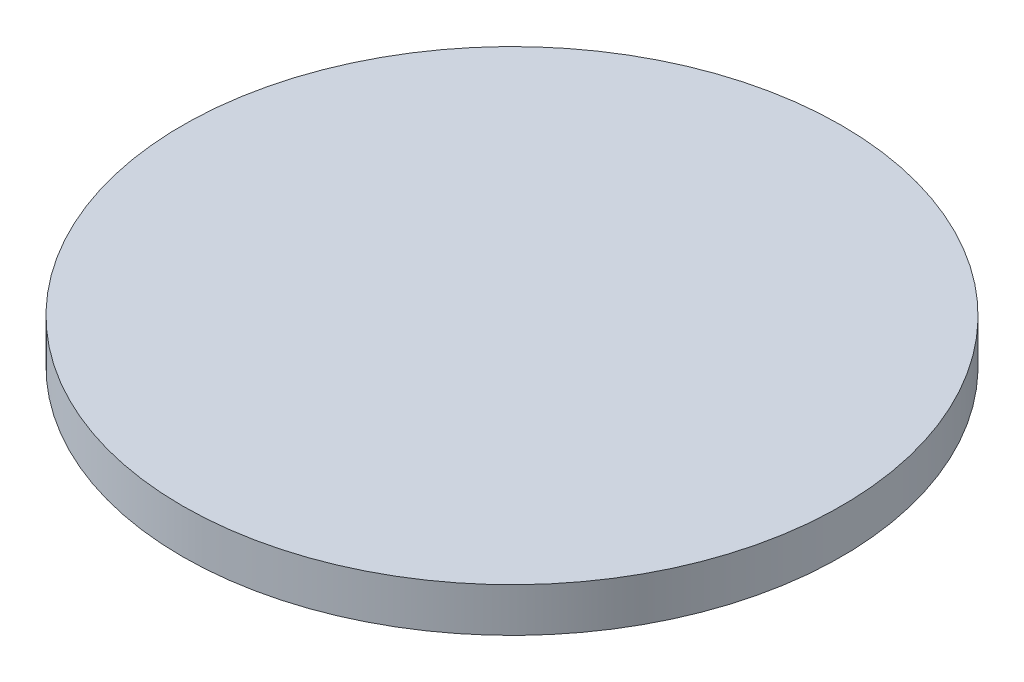
ISO-10303-21;
HEADER;
FILE_DESCRIPTION(('STEP AP214'),'2;1');
FILE_NAME('part.step','',(''),(''),'','','');
FILE_SCHEMA(('AUTOMOTIVE_DESIGN { 1 0 10303 214 1 1 1 1 }'));
ENDSEC;
DATA;
#1=APPLICATION_CONTEXT('core data for automotive mechanical design processes');
#2=APPLICATION_PROTOCOL_DEFINITION('international standard','automotive_design',2000,#1);
#3=PRODUCT_CONTEXT('',#1,'mechanical');
#4=PRODUCT('Part','Part','',(#3));
#5=PRODUCT_RELATED_PRODUCT_CATEGORY('part','',(#4));
#6=PRODUCT_DEFINITION_FORMATION('','',#4);
#7=PRODUCT_DEFINITION_CONTEXT('part definition',#1,'design');
#8=PRODUCT_DEFINITION('design','',#6,#7);
#9=PRODUCT_DEFINITION_SHAPE('','',#8);
#10=(LENGTH_UNIT() NAMED_UNIT(*) SI_UNIT(.MILLI.,.METRE.));
#11=(NAMED_UNIT(*) PLANE_ANGLE_UNIT() SI_UNIT($,.RADIAN.));
#12=(NAMED_UNIT(*) SI_UNIT($,.STERADIAN.) SOLID_ANGLE_UNIT());
#13=UNCERTAINTY_MEASURE_WITH_UNIT(LENGTH_MEASURE(1.E-05),#10,'distance_accuracy_value','');
#14=(GEOMETRIC_REPRESENTATION_CONTEXT(3) GLOBAL_UNCERTAINTY_ASSIGNED_CONTEXT((#13)) GLOBAL_UNIT_ASSIGNED_CONTEXT((#10,
#11,#12)) REPRESENTATION_CONTEXT('',''));
#15=CARTESIAN_POINT('',(0.,0.,0.));
#16=DIRECTION('',(0.,0.,1.));
#17=DIRECTION('',(1.,0.,0.));
#18=AXIS2_PLACEMENT_3D('',#15,#16,#17);
#19=CARTESIAN_POINT('',(0.,1.5,0.));
#20=DIRECTION('',(0.,-1.,0.));
#21=DIRECTION('',(0.,0.,-1.));
#22=AXIS2_PLACEMENT_3D('',#19,#20,#21);
#23=CYLINDRICAL_SURFACE('',#22,22.5);
#24=CARTESIAN_POINT('',(0.,1.5,0.));
#25=DIRECTION('',(0.,1.,0.));
#26=DIRECTION('',(0.,0.,1.));
#27=AXIS2_PLACEMENT_3D('',#24,#25,#26);
#28=CIRCLE('',#27,22.5);
#29=CARTESIAN_POINT('',(0.,1.5,22.5));
#30=VERTEX_POINT('',#29);
#31=EDGE_CURVE('E10',#30,#30,#28,.T.);
#32=ORIENTED_EDGE('',*,*,#31,.F.);
#33=EDGE_LOOP('',(#32));
#34=FACE_BOUND('',#33,.T.);
#35=CARTESIAN_POINT('',(0.,-1.5,0.));
#36=DIRECTION('',(0.,1.,0.));
#37=DIRECTION('',(0.,0.,1.));
#38=AXIS2_PLACEMENT_3D('',#35,#36,#37);
#39=CIRCLE('',#38,22.5);
#40=CARTESIAN_POINT('',(0.,-1.5,22.5));
#41=VERTEX_POINT('',#40);
#42=EDGE_CURVE('E40',#41,#41,#39,.T.);
#43=ORIENTED_EDGE('',*,*,#42,.T.);
#44=EDGE_LOOP('',(#43));
#45=FACE_BOUND('',#44,.T.);
#46=ADVANCED_FACE('F37',(#34,#45),#23,.T.);
#47=CARTESIAN_POINT('',(0.,1.5,0.));
#48=DIRECTION('',(0.,1.,0.));
#49=DIRECTION('',(0.,0.,1.));
#50=AXIS2_PLACEMENT_3D('',#47,#48,#49);
#51=PLANE('',#50);
#52=ORIENTED_EDGE('',*,*,#31,.T.);
#53=EDGE_LOOP('',(#52));
#54=FACE_BOUND('',#53,.T.);
#55=ADVANCED_FACE('F54',(#54),#51,.T.);
#56=CARTESIAN_POINT('',(0.,-1.5,0.));
#57=DIRECTION('',(0.,1.,0.));
#58=DIRECTION('',(0.,0.,1.));
#59=AXIS2_PLACEMENT_3D('',#56,#57,#58);
#60=PLANE('',#59);
#61=ORIENTED_EDGE('',*,*,#42,.F.);
#62=EDGE_LOOP('',(#61));
#63=FACE_BOUND('',#62,.T.);
#64=ADVANCED_FACE('F52',(#63),#60,.F.);
#65=CLOSED_SHELL('',(#46,#55,#64));
#66=MANIFOLD_SOLID_BREP('B2',#65);
#67=ADVANCED_BREP_SHAPE_REPRESENTATION('',(#18,#66),#14);
#68=SHAPE_DEFINITION_REPRESENTATION(#9,#67);
ENDSEC;
END-ISO-10303-21;
